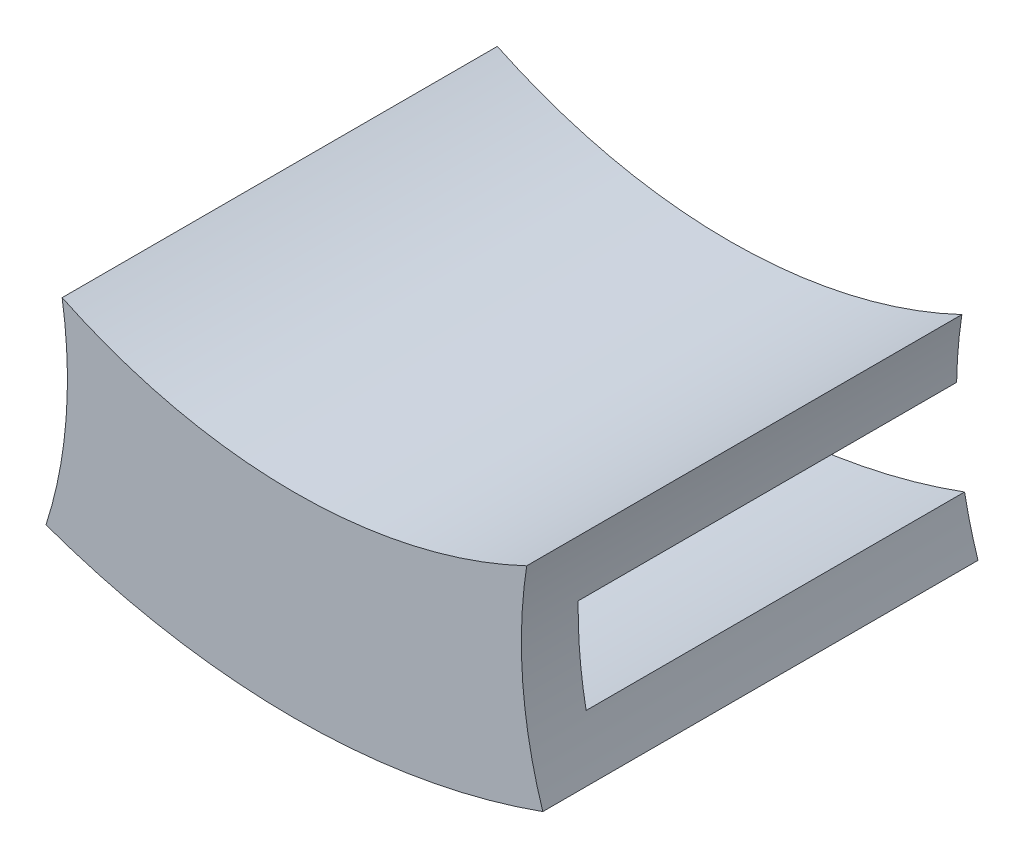
ISO-10303-21;
HEADER;
FILE_DESCRIPTION(('STEP AP214'),'2;1');
FILE_NAME('part.step','',(''),(''),'','','');
FILE_SCHEMA(('AUTOMOTIVE_DESIGN { 1 0 10303 214 1 1 1 1 }'));
ENDSEC;
DATA;
#1=APPLICATION_CONTEXT('core data for automotive mechanical design processes');
#2=APPLICATION_PROTOCOL_DEFINITION('international standard','automotive_design',2000,#1);
#3=PRODUCT_CONTEXT('',#1,'mechanical');
#4=PRODUCT('Part','Part','',(#3));
#5=PRODUCT_RELATED_PRODUCT_CATEGORY('part','',(#4));
#6=PRODUCT_DEFINITION_FORMATION('','',#4);
#7=PRODUCT_DEFINITION_CONTEXT('part definition',#1,'design');
#8=PRODUCT_DEFINITION('design','',#6,#7);
#9=PRODUCT_DEFINITION_SHAPE('','',#8);
#10=(LENGTH_UNIT() NAMED_UNIT(*) SI_UNIT(.MILLI.,.METRE.));
#11=(NAMED_UNIT(*) PLANE_ANGLE_UNIT() SI_UNIT($,.RADIAN.));
#12=(NAMED_UNIT(*) SI_UNIT($,.STERADIAN.) SOLID_ANGLE_UNIT());
#13=UNCERTAINTY_MEASURE_WITH_UNIT(LENGTH_MEASURE(1.E-05),#10,'distance_accuracy_value','');
#14=(GEOMETRIC_REPRESENTATION_CONTEXT(3) GLOBAL_UNCERTAINTY_ASSIGNED_CONTEXT((#13)) GLOBAL_UNIT_ASSIGNED_CONTEXT((#10,
#11,#12)) REPRESENTATION_CONTEXT('',''));
#15=CARTESIAN_POINT('',(0.,0.,0.));
#16=DIRECTION('',(0.,0.,1.));
#17=DIRECTION('',(1.,0.,0.));
#18=AXIS2_PLACEMENT_3D('',#15,#16,#17);
#19=CARTESIAN_POINT('',(-17.7482925060748,50.1733013750045,0.));
#20=DIRECTION('',(0.,0.,-1.));
#21=DIRECTION('',(-1.,0.,0.));
#22=AXIS2_PLACEMENT_3D('',#19,#20,#21);
#23=PLANE('',#22);
#24=CARTESIAN_POINT('',(35.4953724121275,35.4927921144842,0.));
#25=DIRECTION('',(0.,0.,-1.));
#26=DIRECTION('',(1.,0.,0.));
#27=AXIS2_PLACEMENT_3D('',#24,#25,#26);
#28=CIRCLE('',#27,23.5000000000007);
#29=CARTESIAN_POINT('',(12.417221823188,31.0600767622129,0.));
#30=VERTEX_POINT('',#29);
#31=CARTESIAN_POINT('',(11.9983739954369,35.8683788635475,0.));
#32=VERTEX_POINT('',#31);
#33=EDGE_CURVE('E51',#30,#32,#28,.T.);
#34=ORIENTED_EDGE('',*,*,#33,.F.);
#35=CARTESIAN_POINT('',(-0.00121260003390029,64.85381063552,0.));
#36=DIRECTION('',(0.,0.,-1.));
#37=DIRECTION('',(-1.,0.,0.));
#38=AXIS2_PLACEMENT_3D('',#35,#36,#37);
#39=CIRCLE('',#38,36.0032493342443);
#40=CARTESIAN_POINT('',(-12.4173817142714,31.0592443984691,0.));
#41=VERTEX_POINT('',#40);
#42=EDGE_CURVE('E122',#41,#30,#39,.F.);
#43=ORIENTED_EDGE('',*,*,#42,.F.);
#44=CARTESIAN_POINT('',(-35.4953724121156,35.492792114489,0.));
#45=DIRECTION('',(0.,0.,-1.));
#46=DIRECTION('',(-1.,0.,0.));
#47=AXIS2_PLACEMENT_3D('',#44,#45,#46);
#48=CIRCLE('',#47,23.5000000000002);
#49=CARTESIAN_POINT('',(-11.9983578639311,35.8673683048919,0.));
#50=VERTEX_POINT('',#49);
#51=EDGE_CURVE('E126',#50,#41,#48,.T.);
#52=ORIENTED_EDGE('',*,*,#51,.F.);
#53=CARTESIAN_POINT('',(-0.00121260003390029,64.85381063552,0.));
#54=DIRECTION('',(0.,0.,-1.));
#55=DIRECTION('',(-1.,0.,0.));
#56=AXIS2_PLACEMENT_3D('',#53,#54,#55);
#57=CIRCLE('',#56,31.3710907280872);
#58=EDGE_CURVE('E127',#50,#32,#57,.F.);
#59=ORIENTED_EDGE('',*,*,#58,.T.);
#60=EDGE_LOOP('',(#34,#43,#52,#59));
#61=FACE_BOUND('',#60,.T.);
#62=ADVANCED_FACE('F36',(#61),#23,.T.);
#63=CARTESIAN_POINT('',(-35.4953724121156,35.492792114489,3.));
#64=DIRECTION('',(0.,0.,-1.));
#65=DIRECTION('',(-1.,0.,0.));
#66=AXIS2_PLACEMENT_3D('',#63,#64,#65);
#67=CYLINDRICAL_SURFACE('',#66,23.5000000000002);
#68=DIRECTION('',(0.,0.,-1.));
#69=VECTOR('',#68,1.);
#70=CARTESIAN_POINT('',(-12.275256818724,39.108899390213,3.));
#71=LINE('',#70,#69);
#72=CARTESIAN_POINT('',(-12.275256818724,39.108899390213,3.));
#73=VERTEX_POINT('',#72);
#74=CARTESIAN_POINT('',(-12.275256818724,39.108899390213,-20.));
#75=VERTEX_POINT('',#74);
#76=EDGE_CURVE('E156',#73,#75,#71,.T.);
#77=ORIENTED_EDGE('',*,*,#76,.T.);
#78=CARTESIAN_POINT('',(-35.4953724121156,35.492792114489,-20.));
#79=DIRECTION('',(0.,0.,-1.));
#80=DIRECTION('',(-1.,0.,0.));
#81=AXIS2_PLACEMENT_3D('',#78,#79,#80);
#82=CIRCLE('',#81,23.5000000000002);
#83=CARTESIAN_POINT('',(-11.9983578639311,35.8673683048919,-20.));
#84=VERTEX_POINT('',#83);
#85=EDGE_CURVE('E137',#84,#75,#82,.F.);
#86=ORIENTED_EDGE('',*,*,#85,.F.);
#87=DIRECTION('',(0.,0.,1.));
#88=VECTOR('',#87,1.);
#89=CARTESIAN_POINT('',(-11.9983578639311,35.8673683048919,-20.));
#90=LINE('',#89,#88);
#91=EDGE_CURVE('E147',#84,#50,#90,.T.);
#92=ORIENTED_EDGE('',*,*,#91,.T.);
#93=ORIENTED_EDGE('',*,*,#51,.T.);
#94=DIRECTION('',(0.,0.,1.));
#95=VECTOR('',#94,1.);
#96=CARTESIAN_POINT('',(-12.4173817142714,31.0592443984691,-20.));
#97=LINE('',#96,#95);
#98=CARTESIAN_POINT('',(-12.4173817142714,31.0592443984691,-20.));
#99=VERTEX_POINT('',#98);
#100=EDGE_CURVE('E106',#99,#41,#97,.T.);
#101=ORIENTED_EDGE('',*,*,#100,.F.);
#102=CARTESIAN_POINT('',(-35.4953724121156,35.492792114489,-20.));
#103=DIRECTION('',(0.,0.,-1.));
#104=DIRECTION('',(-1.,0.,0.));
#105=AXIS2_PLACEMENT_3D('',#102,#103,#104);
#106=CIRCLE('',#105,23.5000000000002);
#107=CARTESIAN_POINT('',(-13.127971261147,28.2852012720743,-20.));
#108=VERTEX_POINT('',#107);
#109=EDGE_CURVE('E113',#108,#99,#106,.F.);
#110=ORIENTED_EDGE('',*,*,#109,.F.);
#111=DIRECTION('',(0.,0.,-1.));
#112=VECTOR('',#111,1.);
#113=CARTESIAN_POINT('',(-13.127971261147,28.2852012720743,3.));
#114=LINE('',#113,#112);
#115=CARTESIAN_POINT('',(-13.127971261147,28.2852012720743,3.));
#116=VERTEX_POINT('',#115);
#117=EDGE_CURVE('E11',#116,#108,#114,.T.);
#118=ORIENTED_EDGE('',*,*,#117,.F.);
#119=CARTESIAN_POINT('',(-35.4953724121156,35.492792114489,3.));
#120=DIRECTION('',(0.,0.,-1.));
#121=DIRECTION('',(-1.,0.,0.));
#122=AXIS2_PLACEMENT_3D('',#119,#120,#121);
#123=CIRCLE('',#122,23.5000000000002);
#124=EDGE_CURVE('E149',#73,#116,#123,.T.);
#125=ORIENTED_EDGE('',*,*,#124,.F.);
#126=EDGE_LOOP('',(#77,#86,#92,#93,#101,#110,#118,#125));
#127=FACE_BOUND('',#126,.T.);
#128=ADVANCED_FACE('F38',(#127),#67,.F.);
#129=CARTESIAN_POINT('',(-0.00121260003390029,64.85381063552,3.));
#130=DIRECTION('',(0.,0.,-1.));
#131=DIRECTION('',(-1.,0.,0.));
#132=AXIS2_PLACEMENT_3D('',#129,#130,#131);
#133=CYLINDRICAL_SURFACE('',#132,38.8532493328859);
#134=ORIENTED_EDGE('',*,*,#117,.T.);
#135=CARTESIAN_POINT('',(-0.00121260003390029,64.85381063552,-20.));
#136=DIRECTION('',(0.,0.,-1.));
#137=DIRECTION('',(-1.,0.,0.));
#138=AXIS2_PLACEMENT_3D('',#135,#136,#137);
#139=CIRCLE('',#138,38.8532493328859);
#140=CARTESIAN_POINT('',(13.1277198130961,28.2859816404202,-20.));
#141=VERTEX_POINT('',#140);
#142=EDGE_CURVE('E119',#141,#108,#139,.T.);
#143=ORIENTED_EDGE('',*,*,#142,.F.);
#144=DIRECTION('',(0.,0.,-1.));
#145=VECTOR('',#144,1.);
#146=CARTESIAN_POINT('',(13.1277198130961,28.2859816404202,3.));
#147=LINE('',#146,#145);
#148=CARTESIAN_POINT('',(13.1277198130961,28.2859816404202,3.));
#149=VERTEX_POINT('',#148);
#150=EDGE_CURVE('E44',#149,#141,#147,.T.);
#151=ORIENTED_EDGE('',*,*,#150,.F.);
#152=CARTESIAN_POINT('',(-0.00121260003390029,64.85381063552,3.));
#153=DIRECTION('',(0.,0.,1.));
#154=DIRECTION('',(1.,0.,0.));
#155=AXIS2_PLACEMENT_3D('',#152,#153,#154);
#156=CIRCLE('',#155,38.8532493328859);
#157=EDGE_CURVE('E151',#116,#149,#156,.T.);
#158=ORIENTED_EDGE('',*,*,#157,.F.);
#159=EDGE_LOOP('',(#134,#143,#151,#158));
#160=FACE_BOUND('',#159,.T.);
#161=ADVANCED_FACE('F167',(#160),#133,.T.);
#162=CARTESIAN_POINT('',(35.4953724121275,35.4927921144842,3.));
#163=DIRECTION('',(0.,0.,-1.));
#164=DIRECTION('',(-1.,0.,0.));
#165=AXIS2_PLACEMENT_3D('',#162,#163,#164);
#166=CYLINDRICAL_SURFACE('',#165,23.5000000000007);
#167=ORIENTED_EDGE('',*,*,#150,.T.);
#168=CARTESIAN_POINT('',(35.4953724121275,35.4927921144842,-20.));
#169=DIRECTION('',(0.,0.,-1.));
#170=DIRECTION('',(-1.,0.,0.));
#171=AXIS2_PLACEMENT_3D('',#168,#169,#170);
#172=CIRCLE('',#171,23.5000000000007);
#173=CARTESIAN_POINT('',(12.417221823188,31.0600767622129,-20.));
#174=VERTEX_POINT('',#173);
#175=EDGE_CURVE('E112',#174,#141,#172,.F.);
#176=ORIENTED_EDGE('',*,*,#175,.F.);
#177=DIRECTION('',(0.,0.,1.));
#178=VECTOR('',#177,1.);
#179=CARTESIAN_POINT('',(12.417221823188,31.0600767622129,-20.));
#180=LINE('',#179,#178);
#181=EDGE_CURVE('E108',#174,#30,#180,.T.);
#182=ORIENTED_EDGE('',*,*,#181,.T.);
#183=ORIENTED_EDGE('',*,*,#33,.T.);
#184=DIRECTION('',(0.,0.,1.));
#185=VECTOR('',#184,1.);
#186=CARTESIAN_POINT('',(11.9983739954369,35.8683788635475,-20.));
#187=LINE('',#186,#185);
#188=CARTESIAN_POINT('',(11.9983739954369,35.8683788635475,-20.));
#189=VERTEX_POINT('',#188);
#190=EDGE_CURVE('E144',#189,#32,#187,.T.);
#191=ORIENTED_EDGE('',*,*,#190,.F.);
#192=CARTESIAN_POINT('',(35.4953724121275,35.4927921144842,-20.));
#193=DIRECTION('',(0.,0.,-1.));
#194=DIRECTION('',(-1.,0.,0.));
#195=AXIS2_PLACEMENT_3D('',#192,#193,#194);
#196=CIRCLE('',#195,23.5000000000007);
#197=CARTESIAN_POINT('',(12.2754513859381,39.110148543917,-20.));
#198=VERTEX_POINT('',#197);
#199=EDGE_CURVE('E143',#198,#189,#196,.F.);
#200=ORIENTED_EDGE('',*,*,#199,.F.);
#201=DIRECTION('',(0.,0.,-1.));
#202=VECTOR('',#201,1.);
#203=CARTESIAN_POINT('',(12.2754513859381,39.110148543917,3.));
#204=LINE('',#203,#202);
#205=CARTESIAN_POINT('',(12.2754513859381,39.110148543917,3.));
#206=VERTEX_POINT('',#205);
#207=EDGE_CURVE('E160',#206,#198,#204,.T.);
#208=ORIENTED_EDGE('',*,*,#207,.F.);
#209=CARTESIAN_POINT('',(35.4953724121275,35.4927921144842,3.));
#210=DIRECTION('',(0.,0.,-1.));
#211=DIRECTION('',(1.,0.,0.));
#212=AXIS2_PLACEMENT_3D('',#209,#210,#211);
#213=CIRCLE('',#212,23.5000000000007);
#214=EDGE_CURVE('E153',#149,#206,#213,.T.);
#215=ORIENTED_EDGE('',*,*,#214,.F.);
#216=EDGE_LOOP('',(#167,#176,#182,#183,#191,#200,#208,#215));
#217=FACE_BOUND('',#216,.T.);
#218=ADVANCED_FACE('F163',(#217),#166,.F.);
#219=CARTESIAN_POINT('',(-0.00121260003390029,64.85381063552,3.));
#220=DIRECTION('',(0.,0.,-1.));
#221=DIRECTION('',(-1.,0.,0.));
#222=AXIS2_PLACEMENT_3D('',#219,#220,#221);
#223=CYLINDRICAL_SURFACE('',#222,28.5210907314411);
#224=ORIENTED_EDGE('',*,*,#207,.T.);
#225=CARTESIAN_POINT('',(-0.00121260003390029,64.85381063552,-20.));
#226=DIRECTION('',(0.,0.,-1.));
#227=DIRECTION('',(-1.,0.,0.));
#228=AXIS2_PLACEMENT_3D('',#225,#226,#227);
#229=CIRCLE('',#228,28.5210907314411);
#230=EDGE_CURVE('E140',#75,#198,#229,.F.);
#231=ORIENTED_EDGE('',*,*,#230,.F.);
#232=ORIENTED_EDGE('',*,*,#76,.F.);
#233=CARTESIAN_POINT('',(-0.00121260003390029,64.85381063552,3.));
#234=DIRECTION('',(0.,0.,-1.));
#235=DIRECTION('',(1.,0.,0.));
#236=AXIS2_PLACEMENT_3D('',#233,#234,#235);
#237=CIRCLE('',#236,28.5210907314411);
#238=EDGE_CURVE('E59',#206,#73,#237,.T.);
#239=ORIENTED_EDGE('',*,*,#238,.F.);
#240=EDGE_LOOP('',(#224,#231,#232,#239));
#241=FACE_BOUND('',#240,.T.);
#242=ADVANCED_FACE('F180',(#241),#223,.F.);
#243=CARTESIAN_POINT('',(-17.7482925060748,50.1733013750045,3.));
#244=DIRECTION('',(0.,0.,-1.));
#245=DIRECTION('',(-1.,0.,0.));
#246=AXIS2_PLACEMENT_3D('',#243,#244,#245);
#247=PLANE('',#246);
#248=ORIENTED_EDGE('',*,*,#124,.T.);
#249=ORIENTED_EDGE('',*,*,#157,.T.);
#250=ORIENTED_EDGE('',*,*,#214,.T.);
#251=ORIENTED_EDGE('',*,*,#238,.T.);
#252=EDGE_LOOP('',(#248,#249,#250,#251));
#253=FACE_BOUND('',#252,.T.);
#254=ADVANCED_FACE('F182',(#253),#247,.F.);
#255=CARTESIAN_POINT('',(-0.00121260003390029,64.85381063552,-20.));
#256=DIRECTION('',(0.,0.,1.));
#257=DIRECTION('',(1.,0.,0.));
#258=AXIS2_PLACEMENT_3D('',#255,#256,#257);
#259=CYLINDRICAL_SURFACE('',#258,31.3710907280872);
#260=ORIENTED_EDGE('',*,*,#58,.F.);
#261=ORIENTED_EDGE('',*,*,#91,.F.);
#262=CARTESIAN_POINT('',(-0.00121260003390029,64.85381063552,-20.));
#263=DIRECTION('',(0.,0.,-1.));
#264=DIRECTION('',(-1.,0.,0.));
#265=AXIS2_PLACEMENT_3D('',#262,#263,#264);
#266=CIRCLE('',#265,31.3710907280872);
#267=EDGE_CURVE('E130',#84,#189,#266,.F.);
#268=ORIENTED_EDGE('',*,*,#267,.T.);
#269=ORIENTED_EDGE('',*,*,#190,.T.);
#270=EDGE_LOOP('',(#260,#261,#268,#269));
#271=FACE_BOUND('',#270,.T.);
#272=ADVANCED_FACE('F172',(#271),#259,.T.);
#273=CARTESIAN_POINT('',(0.,0.,-20.));
#274=DIRECTION('',(0.,0.,-1.));
#275=DIRECTION('',(-1.,0.,0.));
#276=AXIS2_PLACEMENT_3D('',#273,#274,#275);
#277=PLANE('',#276);
#278=ORIENTED_EDGE('',*,*,#267,.F.);
#279=ORIENTED_EDGE('',*,*,#85,.T.);
#280=ORIENTED_EDGE('',*,*,#230,.T.);
#281=ORIENTED_EDGE('',*,*,#199,.T.);
#282=EDGE_LOOP('',(#278,#279,#280,#281));
#283=FACE_BOUND('',#282,.T.);
#284=ADVANCED_FACE('F177',(#283),#277,.T.);
#285=CARTESIAN_POINT('',(-0.00121260003390029,64.85381063552,-20.));
#286=DIRECTION('',(0.,0.,1.));
#287=DIRECTION('',(1.,0.,0.));
#288=AXIS2_PLACEMENT_3D('',#285,#286,#287);
#289=CYLINDRICAL_SURFACE('',#288,36.0032493342443);
#290=ORIENTED_EDGE('',*,*,#42,.T.);
#291=ORIENTED_EDGE('',*,*,#181,.F.);
#292=CARTESIAN_POINT('',(-0.00121260003390029,64.85381063552,-20.));
#293=DIRECTION('',(0.,0.,-1.));
#294=DIRECTION('',(-1.,0.,0.));
#295=AXIS2_PLACEMENT_3D('',#292,#293,#294);
#296=CIRCLE('',#295,36.0032493342443);
#297=EDGE_CURVE('E102',#99,#174,#296,.F.);
#298=ORIENTED_EDGE('',*,*,#297,.F.);
#299=ORIENTED_EDGE('',*,*,#100,.T.);
#300=EDGE_LOOP('',(#290,#291,#298,#299));
#301=FACE_BOUND('',#300,.T.);
#302=ADVANCED_FACE('F104',(#301),#289,.F.);
#303=CARTESIAN_POINT('',(0.,0.,-20.));
#304=DIRECTION('',(0.,0.,-1.));
#305=DIRECTION('',(-1.,0.,0.));
#306=AXIS2_PLACEMENT_3D('',#303,#304,#305);
#307=PLANE('',#306);
#308=ORIENTED_EDGE('',*,*,#109,.T.);
#309=ORIENTED_EDGE('',*,*,#297,.T.);
#310=ORIENTED_EDGE('',*,*,#175,.T.);
#311=ORIENTED_EDGE('',*,*,#142,.T.);
#312=EDGE_LOOP('',(#308,#309,#310,#311));
#313=FACE_BOUND('',#312,.T.);
#314=ADVANCED_FACE('F117',(#313),#307,.T.);
#315=CLOSED_SHELL('',(#62,#128,#161,#218,#242,#254,#272,#284,#302,#314));
#316=MANIFOLD_SOLID_BREP('B2',#315);
#317=ADVANCED_BREP_SHAPE_REPRESENTATION('',(#18,#316),#14);
#318=SHAPE_DEFINITION_REPRESENTATION(#9,#317);
ENDSEC;
END-ISO-10303-21;
